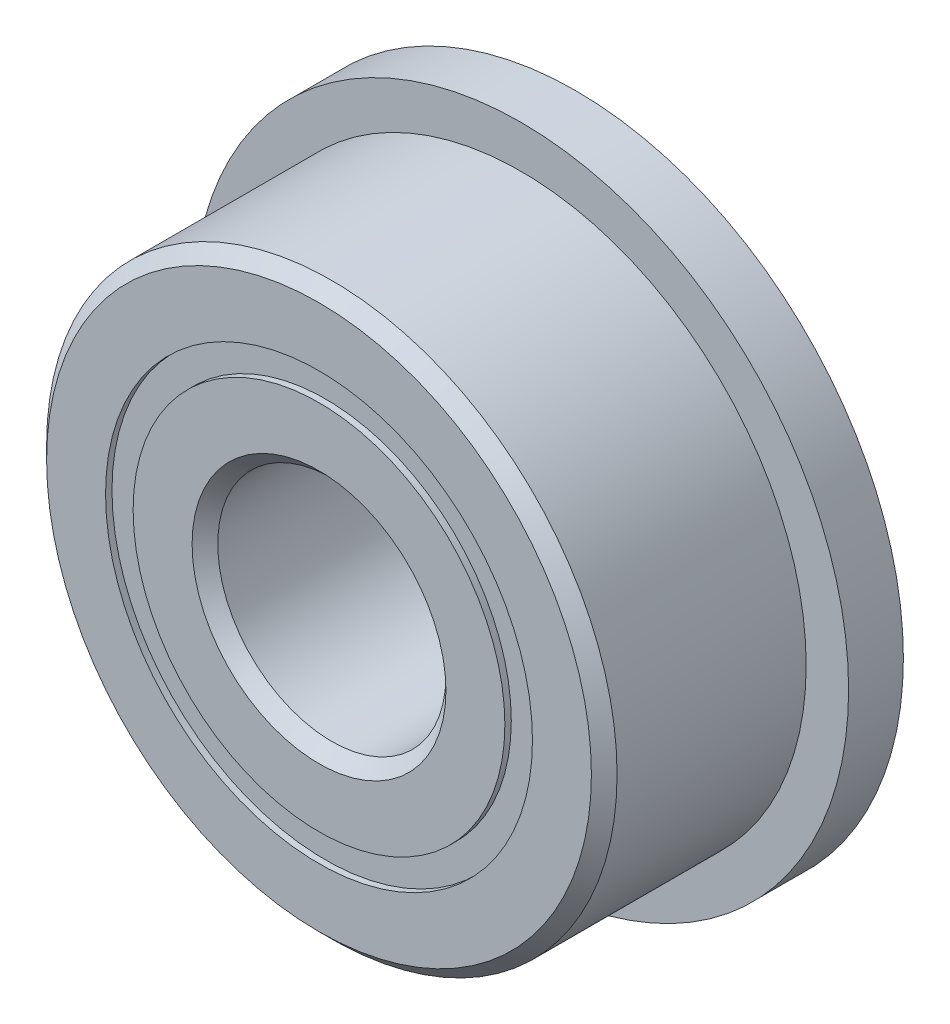
ISO-10303-21;
HEADER;
FILE_DESCRIPTION(('STEP AP214'),'2;1');
FILE_NAME('part.step','',(''),(''),'','','');
FILE_SCHEMA(('AUTOMOTIVE_DESIGN { 1 0 10303 214 1 1 1 1 }'));
ENDSEC;
DATA;
#1=APPLICATION_CONTEXT('core data for automotive mechanical design processes');
#2=APPLICATION_PROTOCOL_DEFINITION('international standard','automotive_design',2000,#1);
#3=PRODUCT_CONTEXT('',#1,'mechanical');
#4=PRODUCT('Part','Part','',(#3));
#5=PRODUCT_RELATED_PRODUCT_CATEGORY('part','',(#4));
#6=PRODUCT_DEFINITION_FORMATION('','',#4);
#7=PRODUCT_DEFINITION_CONTEXT('part definition',#1,'design');
#8=PRODUCT_DEFINITION('design','',#6,#7);
#9=PRODUCT_DEFINITION_SHAPE('','',#8);
#10=(LENGTH_UNIT() NAMED_UNIT(*) SI_UNIT(.MILLI.,.METRE.));
#11=(NAMED_UNIT(*) PLANE_ANGLE_UNIT() SI_UNIT($,.RADIAN.));
#12=(NAMED_UNIT(*) SI_UNIT($,.STERADIAN.) SOLID_ANGLE_UNIT());
#13=UNCERTAINTY_MEASURE_WITH_UNIT(LENGTH_MEASURE(1.E-05),#10,'distance_accuracy_value','');
#14=(GEOMETRIC_REPRESENTATION_CONTEXT(3) GLOBAL_UNCERTAINTY_ASSIGNED_CONTEXT((#13)) GLOBAL_UNIT_ASSIGNED_CONTEXT((#10,
#11,#12)) REPRESENTATION_CONTEXT('',''));
#15=CARTESIAN_POINT('',(0.,0.,0.));
#16=DIRECTION('',(0.,0.,1.));
#17=DIRECTION('',(1.,0.,0.));
#18=AXIS2_PLACEMENT_3D('',#15,#16,#17);
#19=CARTESIAN_POINT('',(0.,2.9700206043956,-1.696640625));
#20=DIRECTION('',(0.,0.,1.));
#21=DIRECTION('',(1.,0.,0.));
#22=AXIS2_PLACEMENT_3D('',#19,#20,#21);
#23=PLANE('',#22);
#24=CARTESIAN_POINT('',(0.,0.,-1.696640625));
#25=DIRECTION('',(0.,0.,1.));
#26=DIRECTION('',(1.,0.,0.));
#27=AXIS2_PLACEMENT_3D('',#24,#25,#26);
#28=CIRCLE('',#27,2.9700206043956);
#29=CARTESIAN_POINT('',(2.9700206043956,0.,-1.696640625));
#30=VERTEX_POINT('',#29);
#31=EDGE_CURVE('E55',#30,#30,#28,.T.);
#32=ORIENTED_EDGE('',*,*,#31,.F.);
#33=EDGE_LOOP('',(#32));
#34=FACE_BOUND('',#33,.T.);
#35=CARTESIAN_POINT('',(0.,0.,-1.696640625));
#36=DIRECTION('',(0.,0.,1.));
#37=DIRECTION('',(1.,0.,0.));
#38=AXIS2_PLACEMENT_3D('',#35,#36,#37);
#39=CIRCLE('',#38,2.5862293956044);
#40=CARTESIAN_POINT('',(2.5862293956044,0.,-1.696640625));
#41=VERTEX_POINT('',#40);
#42=EDGE_CURVE('E11',#41,#41,#39,.T.);
#43=ORIENTED_EDGE('',*,*,#42,.T.);
#44=EDGE_LOOP('',(#43));
#45=FACE_BOUND('',#44,.T.);
#46=ADVANCED_FACE('F41',(#34,#45),#23,.F.);
#47=CARTESIAN_POINT('',(0.,0.,1.7859375));
#48=DIRECTION('',(0.,0.,1.));
#49=DIRECTION('',(1.,0.,0.));
#50=AXIS2_PLACEMENT_3D('',#47,#48,#49);
#51=CYLINDRICAL_SURFACE('',#50,2.5862293956044);
#52=ORIENTED_EDGE('',*,*,#42,.F.);
#53=EDGE_LOOP('',(#52));
#54=FACE_BOUND('',#53,.T.);
#55=CARTESIAN_POINT('',(0.,0.,-0.816616792312254));
#56=DIRECTION('',(0.,0.,1.));
#57=DIRECTION('',(1.,0.,0.));
#58=AXIS2_PLACEMENT_3D('',#55,#56,#57);
#59=CIRCLE('',#58,2.5862293956044);
#60=CARTESIAN_POINT('',(2.5862293956044,0.,-0.816616792312254));
#61=VERTEX_POINT('',#60);
#62=EDGE_CURVE('E47',#61,#61,#59,.T.);
#63=ORIENTED_EDGE('',*,*,#62,.T.);
#64=EDGE_LOOP('',(#63));
#65=FACE_BOUND('',#64,.T.);
#66=ADVANCED_FACE('F64',(#54,#65),#51,.F.);
#67=CARTESIAN_POINT('',(0.,2.9700206043956,-0.816616792312254));
#68=DIRECTION('',(0.,0.,-1.));
#69=DIRECTION('',(-1.,0.,0.));
#70=AXIS2_PLACEMENT_3D('',#67,#68,#69);
#71=PLANE('',#70);
#72=ORIENTED_EDGE('',*,*,#62,.F.);
#73=EDGE_LOOP('',(#72));
#74=FACE_BOUND('',#73,.T.);
#75=CARTESIAN_POINT('',(0.,0.,-0.816616792312254));
#76=DIRECTION('',(0.,0.,1.));
#77=DIRECTION('',(1.,0.,0.));
#78=AXIS2_PLACEMENT_3D('',#75,#76,#77);
#79=CIRCLE('',#78,2.9700206043956);
#80=CARTESIAN_POINT('',(2.9700206043956,0.,-0.816616792312254));
#81=VERTEX_POINT('',#80);
#82=EDGE_CURVE('E51',#81,#81,#79,.T.);
#83=ORIENTED_EDGE('',*,*,#82,.T.);
#84=EDGE_LOOP('',(#83));
#85=FACE_BOUND('',#84,.T.);
#86=ADVANCED_FACE('F68',(#74,#85),#71,.F.);
#87=CARTESIAN_POINT('',(0.,0.,1.7859375));
#88=DIRECTION('',(0.,0.,1.));
#89=DIRECTION('',(1.,0.,0.));
#90=AXIS2_PLACEMENT_3D('',#87,#88,#89);
#91=CYLINDRICAL_SURFACE('',#90,2.9700206043956);
#92=ORIENTED_EDGE('',*,*,#82,.F.);
#93=EDGE_LOOP('',(#92));
#94=FACE_BOUND('',#93,.T.);
#95=ORIENTED_EDGE('',*,*,#31,.T.);
#96=EDGE_LOOP('',(#95));
#97=FACE_BOUND('',#96,.T.);
#98=ADVANCED_FACE('F61',(#94,#97),#91,.T.);
#99=CLOSED_SHELL('',(#46,#66,#86,#98));
#100=MANIFOLD_SOLID_BREP('B2',#99);
#101=CARTESIAN_POINT('',(0.,2.9700206043956,1.696640625));
#102=DIRECTION('',(0.,0.,-1.));
#103=DIRECTION('',(-1.,0.,0.));
#104=AXIS2_PLACEMENT_3D('',#101,#102,#103);
#105=PLANE('',#104);
#106=CARTESIAN_POINT('',(0.,0.,1.696640625));
#107=DIRECTION('',(0.,0.,1.));
#108=DIRECTION('',(1.,0.,0.));
#109=AXIS2_PLACEMENT_3D('',#106,#107,#108);
#110=CIRCLE('',#109,2.5862293956044);
#111=CARTESIAN_POINT('',(2.5862293956044,0.,1.696640625));
#112=VERTEX_POINT('',#111);
#113=EDGE_CURVE('E40',#112,#112,#110,.T.);
#114=ORIENTED_EDGE('',*,*,#113,.F.);
#115=EDGE_LOOP('',(#114));
#116=FACE_BOUND('',#115,.T.);
#117=CARTESIAN_POINT('',(0.,0.,1.696640625));
#118=DIRECTION('',(0.,0.,1.));
#119=DIRECTION('',(1.,0.,0.));
#120=AXIS2_PLACEMENT_3D('',#117,#118,#119);
#121=CIRCLE('',#120,2.9700206043956);
#122=CARTESIAN_POINT('',(2.9700206043956,0.,1.696640625));
#123=VERTEX_POINT('',#122);
#124=EDGE_CURVE('E122',#123,#123,#121,.T.);
#125=ORIENTED_EDGE('',*,*,#124,.T.);
#126=EDGE_LOOP('',(#125));
#127=FACE_BOUND('',#126,.T.);
#128=ADVANCED_FACE('F108',(#116,#127),#105,.F.);
#129=CARTESIAN_POINT('',(0.,0.,1.7859375));
#130=DIRECTION('',(0.,0.,1.));
#131=DIRECTION('',(1.,0.,0.));
#132=AXIS2_PLACEMENT_3D('',#129,#130,#131);
#133=CYLINDRICAL_SURFACE('',#132,2.5862293956044);
#134=CARTESIAN_POINT('',(0.,0.,0.816616792312253));
#135=DIRECTION('',(0.,0.,1.));
#136=DIRECTION('',(1.,0.,0.));
#137=AXIS2_PLACEMENT_3D('',#134,#135,#136);
#138=CIRCLE('',#137,2.5862293956044);
#139=CARTESIAN_POINT('',(2.5862293956044,0.,0.816616792312253));
#140=VERTEX_POINT('',#139);
#141=EDGE_CURVE('E114',#140,#140,#138,.T.);
#142=ORIENTED_EDGE('',*,*,#141,.F.);
#143=EDGE_LOOP('',(#142));
#144=FACE_BOUND('',#143,.T.);
#145=ORIENTED_EDGE('',*,*,#113,.T.);
#146=EDGE_LOOP('',(#145));
#147=FACE_BOUND('',#146,.T.);
#148=ADVANCED_FACE('F137',(#144,#147),#133,.F.);
#149=CARTESIAN_POINT('',(0.,2.9700206043956,0.816616792312253));
#150=DIRECTION('',(0.,0.,1.));
#151=DIRECTION('',(1.,0.,0.));
#152=AXIS2_PLACEMENT_3D('',#149,#150,#151);
#153=PLANE('',#152);
#154=CARTESIAN_POINT('',(0.,0.,0.816616792312253));
#155=DIRECTION('',(0.,0.,1.));
#156=DIRECTION('',(1.,0.,0.));
#157=AXIS2_PLACEMENT_3D('',#154,#155,#156);
#158=CIRCLE('',#157,2.9700206043956);
#159=CARTESIAN_POINT('',(2.9700206043956,0.,0.816616792312253));
#160=VERTEX_POINT('',#159);
#161=EDGE_CURVE('E118',#160,#160,#158,.T.);
#162=ORIENTED_EDGE('',*,*,#161,.F.);
#163=EDGE_LOOP('',(#162));
#164=FACE_BOUND('',#163,.T.);
#165=ORIENTED_EDGE('',*,*,#141,.T.);
#166=EDGE_LOOP('',(#165));
#167=FACE_BOUND('',#166,.T.);
#168=ADVANCED_FACE('F132',(#164,#167),#153,.F.);
#169=CARTESIAN_POINT('',(0.,0.,1.7859375));
#170=DIRECTION('',(0.,0.,1.));
#171=DIRECTION('',(1.,0.,0.));
#172=AXIS2_PLACEMENT_3D('',#169,#170,#171);
#173=CYLINDRICAL_SURFACE('',#172,2.9700206043956);
#174=ORIENTED_EDGE('',*,*,#124,.F.);
#175=EDGE_LOOP('',(#174));
#176=FACE_BOUND('',#175,.T.);
#177=ORIENTED_EDGE('',*,*,#161,.T.);
#178=EDGE_LOOP('',(#177));
#179=FACE_BOUND('',#178,.T.);
#180=ADVANCED_FACE('F129',(#176,#179),#173,.T.);
#181=CLOSED_SHELL('',(#128,#148,#168,#180));
#182=MANIFOLD_SOLID_BREP('B6',#181);
#183=CARTESIAN_POINT('',(-1.38906249999997,2.40592682488866,0.));
#184=DIRECTION('',(0.,0.,1.));
#185=DIRECTION('',(-0.499999999999989,0.866025403784445,0.));
#186=AXIS2_PLACEMENT_3D('',#183,#184,#185);
#187=SPHERICAL_SURFACE('',#186,0.816616792312253);
#188=CARTESIAN_POINT('',(-1.38906249999997,2.40592682488866,0.816616792312253));
#189=VERTEX_POINT('',#188);
#190=VERTEX_LOOP('',#189);
#191=FACE_BOUND('',#190,.T.);
#192=ADVANCED_FACE('F175',(#191),#187,.T.);
#193=CLOSED_SHELL('',(#192));
#194=MANIFOLD_SOLID_BREP('B35',#193);
#195=CARTESIAN_POINT('',(-2.40592682488863,1.38906250000003,0.));
#196=DIRECTION('',(0.,0.,1.));
#197=DIRECTION('',(-0.866025403784433,0.50000000000001,0.));
#198=AXIS2_PLACEMENT_3D('',#195,#196,#197);
#199=SPHERICAL_SURFACE('',#198,0.816616792312253);
#200=CARTESIAN_POINT('',(-2.40592682488863,1.38906250000003,0.816616792312253));
#201=VERTEX_POINT('',#200);
#202=VERTEX_LOOP('',#201);
#203=FACE_BOUND('',#202,.T.);
#204=ADVANCED_FACE('F195',(#203),#199,.T.);
#205=CLOSED_SHELL('',(#204));
#206=MANIFOLD_SOLID_BREP('B104',#205);
#207=CARTESIAN_POINT('',(-2.778125,0.,0.));
#208=DIRECTION('',(0.,0.,1.));
#209=DIRECTION('',(-1.,0.,0.));
#210=AXIS2_PLACEMENT_3D('',#207,#208,#209);
#211=SPHERICAL_SURFACE('',#210,0.816616792312253);
#212=CARTESIAN_POINT('',(-2.778125,0.,0.816616792312253));
#213=VERTEX_POINT('',#212);
#214=VERTEX_LOOP('',#213);
#215=FACE_BOUND('',#214,.T.);
#216=ADVANCED_FACE('F215',(#215),#211,.T.);
#217=CLOSED_SHELL('',(#216));
#218=MANIFOLD_SOLID_BREP('B171',#217);
#219=CARTESIAN_POINT('',(-2.40592682488866,-1.38906249999998,0.));
#220=DIRECTION('',(0.,0.,1.));
#221=DIRECTION('',(-0.866025403784443,-0.499999999999992,0.));
#222=AXIS2_PLACEMENT_3D('',#219,#220,#221);
#223=SPHERICAL_SURFACE('',#222,0.816616792312253);
#224=CARTESIAN_POINT('',(-2.40592682488866,-1.38906249999998,0.816616792312253));
#225=VERTEX_POINT('',#224);
#226=VERTEX_LOOP('',#225);
#227=FACE_BOUND('',#226,.T.);
#228=ADVANCED_FACE('F235',(#227),#223,.T.);
#229=CLOSED_SHELL('',(#228));
#230=MANIFOLD_SOLID_BREP('B191',#229);
#231=CARTESIAN_POINT('',(-1.38906250000002,-2.40592682488863,0.));
#232=DIRECTION('',(0.,0.,1.));
#233=DIRECTION('',(-0.500000000000007,-0.866025403784435,0.));
#234=AXIS2_PLACEMENT_3D('',#231,#232,#233);
#235=SPHERICAL_SURFACE('',#234,0.816616792312253);
#236=CARTESIAN_POINT('',(-1.38906250000002,-2.40592682488863,0.816616792312253));
#237=VERTEX_POINT('',#236);
#238=VERTEX_LOOP('',#237);
#239=FACE_BOUND('',#238,.T.);
#240=ADVANCED_FACE('F255',(#239),#235,.T.);
#241=CLOSED_SHELL('',(#240));
#242=MANIFOLD_SOLID_BREP('B211',#241);
#243=CARTESIAN_POINT('',(0.,-2.778125,0.));
#244=DIRECTION('',(0.,0.,1.));
#245=DIRECTION('',(0.,-1.,0.));
#246=AXIS2_PLACEMENT_3D('',#243,#244,#245);
#247=SPHERICAL_SURFACE('',#246,0.816616792312253);
#248=CARTESIAN_POINT('',(0.,-2.778125,0.816616792312253));
#249=VERTEX_POINT('',#248);
#250=VERTEX_LOOP('',#249);
#251=FACE_BOUND('',#250,.T.);
#252=ADVANCED_FACE('F275',(#251),#247,.T.);
#253=CLOSED_SHELL('',(#252));
#254=MANIFOLD_SOLID_BREP('B231',#253);
#255=CARTESIAN_POINT('',(1.38906249999999,-2.40592682488865,0.));
#256=DIRECTION('',(0.,0.,1.));
#257=DIRECTION('',(0.499999999999995,-0.866025403784442,0.));
#258=AXIS2_PLACEMENT_3D('',#255,#256,#257);
#259=SPHERICAL_SURFACE('',#258,0.816616792312253);
#260=CARTESIAN_POINT('',(1.38906249999999,-2.40592682488865,0.816616792312253));
#261=VERTEX_POINT('',#260);
#262=VERTEX_LOOP('',#261);
#263=FACE_BOUND('',#262,.T.);
#264=ADVANCED_FACE('F295',(#263),#259,.T.);
#265=CLOSED_SHELL('',(#264));
#266=MANIFOLD_SOLID_BREP('B251',#265);
#267=CARTESIAN_POINT('',(2.40592682488864,-1.38906250000001,0.));
#268=DIRECTION('',(0.,0.,1.));
#269=DIRECTION('',(0.866025403784436,-0.500000000000004,0.));
#270=AXIS2_PLACEMENT_3D('',#267,#268,#269);
#271=SPHERICAL_SURFACE('',#270,0.816616792312253);
#272=CARTESIAN_POINT('',(2.40592682488864,-1.38906250000001,0.816616792312253));
#273=VERTEX_POINT('',#272);
#274=VERTEX_LOOP('',#273);
#275=FACE_BOUND('',#274,.T.);
#276=ADVANCED_FACE('F315',(#275),#271,.T.);
#277=CLOSED_SHELL('',(#276));
#278=MANIFOLD_SOLID_BREP('B271',#277);
#279=CARTESIAN_POINT('',(2.778125,0.,0.));
#280=DIRECTION('',(0.,0.,1.));
#281=DIRECTION('',(1.,0.,0.));
#282=AXIS2_PLACEMENT_3D('',#279,#280,#281);
#283=SPHERICAL_SURFACE('',#282,0.816616792312253);
#284=CARTESIAN_POINT('',(2.778125,0.,0.816616792312253));
#285=VERTEX_POINT('',#284);
#286=VERTEX_LOOP('',#285);
#287=FACE_BOUND('',#286,.T.);
#288=ADVANCED_FACE('F335',(#287),#283,.T.);
#289=CLOSED_SHELL('',(#288));
#290=MANIFOLD_SOLID_BREP('B291',#289);
#291=CARTESIAN_POINT('',(2.40592682488865,1.38906249999999,0.));
#292=DIRECTION('',(0.,0.,1.));
#293=DIRECTION('',(0.86602540378444,0.499999999999998,0.));
#294=AXIS2_PLACEMENT_3D('',#291,#292,#293);
#295=SPHERICAL_SURFACE('',#294,0.816616792312253);
#296=CARTESIAN_POINT('',(2.40592682488865,1.38906249999999,0.816616792312253));
#297=VERTEX_POINT('',#296);
#298=VERTEX_LOOP('',#297);
#299=FACE_BOUND('',#298,.T.);
#300=ADVANCED_FACE('F355',(#299),#295,.T.);
#301=CLOSED_SHELL('',(#300));
#302=MANIFOLD_SOLID_BREP('B311',#301);
#303=CARTESIAN_POINT('',(1.3890625,2.40592682488864,0.));
#304=DIRECTION('',(0.,0.,1.));
#305=DIRECTION('',(0.500000000000001,0.866025403784438,0.));
#306=AXIS2_PLACEMENT_3D('',#303,#304,#305);
#307=SPHERICAL_SURFACE('',#306,0.816616792312253);
#308=CARTESIAN_POINT('',(1.3890625,2.40592682488864,0.816616792312253));
#309=VERTEX_POINT('',#308);
#310=VERTEX_LOOP('',#309);
#311=FACE_BOUND('',#310,.T.);
#312=ADVANCED_FACE('F375',(#311),#307,.T.);
#313=CLOSED_SHELL('',(#312));
#314=MANIFOLD_SOLID_BREP('B331',#313);
#315=CARTESIAN_POINT('',(0.,2.778125,0.));
#316=DIRECTION('',(0.,0.,1.));
#317=DIRECTION('',(0.,1.,0.));
#318=AXIS2_PLACEMENT_3D('',#315,#316,#317);
#319=SPHERICAL_SURFACE('',#318,0.816616792312253);
#320=CARTESIAN_POINT('',(0.,2.778125,0.816616792312253));
#321=VERTEX_POINT('',#320);
#322=VERTEX_LOOP('',#321);
#323=FACE_BOUND('',#322,.T.);
#324=ADVANCED_FACE('F397',(#323),#319,.T.);
#325=CLOSED_SHELL('',(#324));
#326=MANIFOLD_SOLID_BREP('B351',#325);
#327=CARTESIAN_POINT('',(0.,2.5862293956044,1.7859375));
#328=DIRECTION('',(0.,0.,-1.));
#329=DIRECTION('',(-1.,0.,0.));
#330=AXIS2_PLACEMENT_3D('',#327,#328,#329);
#331=PLANE('',#330);
#332=CARTESIAN_POINT('',(0.,0.,1.7859375));
#333=DIRECTION('',(0.,0.,1.));
#334=DIRECTION('',(1.,0.,0.));
#335=AXIS2_PLACEMENT_3D('',#332,#333,#334);
#336=CIRCLE('',#335,1.76609375);
#337=CARTESIAN_POINT('',(1.76609375,0.,1.7859375));
#338=VERTEX_POINT('',#337);
#339=EDGE_CURVE('E444',#338,#338,#336,.T.);
#340=ORIENTED_EDGE('',*,*,#339,.F.);
#341=EDGE_LOOP('',(#340));
#342=FACE_BOUND('',#341,.T.);
#343=CARTESIAN_POINT('',(0.,0.,1.7859375));
#344=DIRECTION('',(0.,0.,1.));
#345=DIRECTION('',(1.,0.,0.));
#346=AXIS2_PLACEMENT_3D('',#343,#344,#345);
#347=CIRCLE('',#346,2.5862293956044);
#348=CARTESIAN_POINT('',(2.5862293956044,0.,1.7859375));
#349=VERTEX_POINT('',#348);
#350=EDGE_CURVE('E396',#349,#349,#347,.T.);
#351=ORIENTED_EDGE('',*,*,#350,.T.);
#352=EDGE_LOOP('',(#351));
#353=FACE_BOUND('',#352,.T.);
#354=ADVANCED_FACE('F416',(#342,#353),#331,.F.);
#355=CARTESIAN_POINT('',(0.,0.,1.7859375));
#356=DIRECTION('',(0.,0.,1.));
#357=DIRECTION('',(1.,0.,0.));
#358=AXIS2_PLACEMENT_3D('',#355,#356,#357);
#359=CYLINDRICAL_SURFACE('',#358,2.5862293956044);
#360=ORIENTED_EDGE('',*,*,#350,.F.);
#361=EDGE_LOOP('',(#360));
#362=FACE_BOUND('',#361,.T.);
#363=CARTESIAN_POINT('',(0.,0.,0.79375));
#364=DIRECTION('',(0.,0.,1.));
#365=DIRECTION('',(1.,0.,0.));
#366=AXIS2_PLACEMENT_3D('',#363,#364,#365);
#367=CIRCLE('',#366,2.5862293956044);
#368=CARTESIAN_POINT('',(2.5862293956044,0.,0.79375));
#369=VERTEX_POINT('',#368);
#370=EDGE_CURVE('E422',#369,#369,#367,.T.);
#371=ORIENTED_EDGE('',*,*,#370,.T.);
#372=EDGE_LOOP('',(#371));
#373=FACE_BOUND('',#372,.T.);
#374=ADVANCED_FACE('F451',(#362,#373),#359,.T.);
#375=CARTESIAN_POINT('',(0.,0.,0.));
#376=DIRECTION('',(0.,0.,1.));
#377=DIRECTION('',(1.,0.,0.));
#378=AXIS2_PLACEMENT_3D('',#375,#376,#377);
#379=TOROIDAL_SURFACE('',#378,2.778125,0.816616792312252);
#380=ORIENTED_EDGE('',*,*,#370,.F.);
#381=EDGE_LOOP('',(#380));
#382=FACE_BOUND('',#381,.T.);
#383=CARTESIAN_POINT('',(0.,0.,-0.793750000000001));
#384=DIRECTION('',(0.,0.,1.));
#385=DIRECTION('',(1.,0.,0.));
#386=AXIS2_PLACEMENT_3D('',#383,#384,#385);
#387=CIRCLE('',#386,2.5862293956044);
#388=CARTESIAN_POINT('',(2.5862293956044,0.,-0.793750000000001));
#389=VERTEX_POINT('',#388);
#390=EDGE_CURVE('E426',#389,#389,#387,.T.);
#391=ORIENTED_EDGE('',*,*,#390,.T.);
#392=EDGE_LOOP('',(#391));
#393=FACE_BOUND('',#392,.T.);
#394=ADVANCED_FACE('F455',(#382,#393),#379,.F.);
#395=CARTESIAN_POINT('',(0.,0.,1.7859375));
#396=DIRECTION('',(0.,0.,1.));
#397=DIRECTION('',(1.,0.,0.));
#398=AXIS2_PLACEMENT_3D('',#395,#396,#397);
#399=CYLINDRICAL_SURFACE('',#398,2.5862293956044);
#400=ORIENTED_EDGE('',*,*,#390,.F.);
#401=EDGE_LOOP('',(#400));
#402=FACE_BOUND('',#401,.T.);
#403=CARTESIAN_POINT('',(0.,0.,-1.7859375));
#404=DIRECTION('',(0.,0.,1.));
#405=DIRECTION('',(1.,0.,0.));
#406=AXIS2_PLACEMENT_3D('',#403,#404,#405);
#407=CIRCLE('',#406,2.5862293956044);
#408=CARTESIAN_POINT('',(2.5862293956044,0.,-1.7859375));
#409=VERTEX_POINT('',#408);
#410=EDGE_CURVE('E430',#409,#409,#407,.T.);
#411=ORIENTED_EDGE('',*,*,#410,.T.);
#412=EDGE_LOOP('',(#411));
#413=FACE_BOUND('',#412,.T.);
#414=ADVANCED_FACE('F460',(#402,#413),#399,.T.);
#415=CARTESIAN_POINT('',(0.,1.76609375,-1.7859375));
#416=DIRECTION('',(0.,0.,1.));
#417=DIRECTION('',(1.,0.,0.));
#418=AXIS2_PLACEMENT_3D('',#415,#416,#417);
#419=PLANE('',#418);
#420=ORIENTED_EDGE('',*,*,#410,.F.);
#421=EDGE_LOOP('',(#420));
#422=FACE_BOUND('',#421,.T.);
#423=CARTESIAN_POINT('',(0.,0.,-1.7859375));
#424=DIRECTION('',(0.,0.,1.));
#425=DIRECTION('',(1.,0.,0.));
#426=AXIS2_PLACEMENT_3D('',#423,#424,#425);
#427=CIRCLE('',#426,1.76609375);
#428=CARTESIAN_POINT('',(1.76609375,0.,-1.7859375));
#429=VERTEX_POINT('',#428);
#430=EDGE_CURVE('E435',#429,#429,#427,.T.);
#431=ORIENTED_EDGE('',*,*,#430,.T.);
#432=EDGE_LOOP('',(#431));
#433=FACE_BOUND('',#432,.T.);
#434=ADVANCED_FACE('F466',(#422,#433),#419,.F.);
#435=CARTESIAN_POINT('',(0.,0.,-1.60734375));
#436=DIRECTION('',(0.,0.,-1.));
#437=DIRECTION('',(-1.,0.,0.));
#438=AXIS2_PLACEMENT_3D('',#435,#436,#437);
#439=CONICAL_SURFACE('',#438,1.5875,0.785398163397448);
#440=ORIENTED_EDGE('',*,*,#430,.F.);
#441=EDGE_LOOP('',(#440));
#442=FACE_BOUND('',#441,.T.);
#443=CARTESIAN_POINT('',(0.,0.,-1.60734375));
#444=DIRECTION('',(0.,0.,1.));
#445=DIRECTION('',(1.,0.,0.));
#446=AXIS2_PLACEMENT_3D('',#443,#444,#445);
#447=CIRCLE('',#446,1.5875);
#448=CARTESIAN_POINT('',(1.5875,0.,-1.60734375));
#449=VERTEX_POINT('',#448);
#450=EDGE_CURVE('E438',#449,#449,#447,.T.);
#451=ORIENTED_EDGE('',*,*,#450,.T.);
#452=EDGE_LOOP('',(#451));
#453=FACE_BOUND('',#452,.T.);
#454=ADVANCED_FACE('F470',(#442,#453),#439,.F.);
#455=CARTESIAN_POINT('',(0.,0.,1.7859375));
#456=DIRECTION('',(0.,0.,1.));
#457=DIRECTION('',(1.,0.,0.));
#458=AXIS2_PLACEMENT_3D('',#455,#456,#457);
#459=CYLINDRICAL_SURFACE('',#458,1.5875);
#460=ORIENTED_EDGE('',*,*,#450,.F.);
#461=EDGE_LOOP('',(#460));
#462=FACE_BOUND('',#461,.T.);
#463=CARTESIAN_POINT('',(0.,0.,1.60734375));
#464=DIRECTION('',(0.,0.,1.));
#465=DIRECTION('',(1.,0.,0.));
#466=AXIS2_PLACEMENT_3D('',#463,#464,#465);
#467=CIRCLE('',#466,1.5875);
#468=CARTESIAN_POINT('',(1.5875,0.,1.60734375));
#469=VERTEX_POINT('',#468);
#470=EDGE_CURVE('E441',#469,#469,#467,.T.);
#471=ORIENTED_EDGE('',*,*,#470,.T.);
#472=EDGE_LOOP('',(#471));
#473=FACE_BOUND('',#472,.T.);
#474=ADVANCED_FACE('F474',(#462,#473),#459,.F.);
#475=CARTESIAN_POINT('',(0.,0.,1.7859375));
#476=DIRECTION('',(0.,0.,1.));
#477=DIRECTION('',(1.,0.,0.));
#478=AXIS2_PLACEMENT_3D('',#475,#476,#477);
#479=CONICAL_SURFACE('',#478,1.76609375,0.785398163397453);
#480=ORIENTED_EDGE('',*,*,#470,.F.);
#481=EDGE_LOOP('',(#480));
#482=FACE_BOUND('',#481,.T.);
#483=ORIENTED_EDGE('',*,*,#339,.T.);
#484=EDGE_LOOP('',(#483));
#485=FACE_BOUND('',#484,.T.);
#486=ADVANCED_FACE('F448',(#482,#485),#479,.F.);
#487=CLOSED_SHELL('',(#354,#374,#394,#414,#434,#454,#474,#486));
#488=MANIFOLD_SOLID_BREP('B371',#487);
#489=CARTESIAN_POINT('',(0.,0.,1.60734375));
#490=DIRECTION('',(0.,0.,-1.));
#491=DIRECTION('',(-1.,0.,0.));
#492=AXIS2_PLACEMENT_3D('',#489,#490,#491);
#493=CONICAL_SURFACE('',#492,3.96875,0.785398163397448);
#494=CARTESIAN_POINT('',(0.,0.,1.7859375));
#495=DIRECTION('',(0.,0.,1.));
#496=DIRECTION('',(1.,0.,0.));
#497=AXIS2_PLACEMENT_3D('',#494,#495,#496);
#498=CIRCLE('',#497,3.79015625);
#499=CARTESIAN_POINT('',(3.79015625,0.,1.7859375));
#500=VERTEX_POINT('',#499);
#501=EDGE_CURVE('E559',#500,#500,#498,.T.);
#502=ORIENTED_EDGE('',*,*,#501,.F.);
#503=EDGE_LOOP('',(#502));
#504=FACE_BOUND('',#503,.T.);
#505=CARTESIAN_POINT('',(0.,0.,1.60734375));
#506=DIRECTION('',(0.,0.,1.));
#507=DIRECTION('',(1.,0.,0.));
#508=AXIS2_PLACEMENT_3D('',#505,#506,#507);
#509=CIRCLE('',#508,3.96875);
#510=CARTESIAN_POINT('',(3.96875,0.,1.60734375));
#511=VERTEX_POINT('',#510);
#512=EDGE_CURVE('E415',#511,#511,#509,.T.);
#513=ORIENTED_EDGE('',*,*,#512,.T.);
#514=EDGE_LOOP('',(#513));
#515=FACE_BOUND('',#514,.T.);
#516=ADVANCED_FACE('F537',(#504,#515),#493,.T.);
#517=CARTESIAN_POINT('',(0.,0.,1.7859375));
#518=DIRECTION('',(0.,0.,1.));
#519=DIRECTION('',(1.,0.,0.));
#520=AXIS2_PLACEMENT_3D('',#517,#518,#519);
#521=CYLINDRICAL_SURFACE('',#520,3.96875);
#522=CARTESIAN_POINT('',(0.,0.,-1.0239375));
#523=DIRECTION('',(0.,0.,1.));
#524=DIRECTION('',(1.,0.,0.));
#525=AXIS2_PLACEMENT_3D('',#522,#523,#524);
#526=CIRCLE('',#525,3.96875);
#527=CARTESIAN_POINT('',(3.96875,0.,-1.0239375));
#528=VERTEX_POINT('',#527);
#529=EDGE_CURVE('E562',#528,#528,#526,.T.);
#530=ORIENTED_EDGE('',*,*,#529,.T.);
#531=EDGE_LOOP('',(#530));
#532=FACE_BOUND('',#531,.T.);
#533=ORIENTED_EDGE('',*,*,#512,.F.);
#534=EDGE_LOOP('',(#533));
#535=FACE_BOUND('',#534,.T.);
#536=ADVANCED_FACE('F582',(#532,#535),#521,.T.);
#537=CARTESIAN_POINT('',(0.,3.79015625,-1.7859375));
#538=DIRECTION('',(0.,0.,1.));
#539=DIRECTION('',(1.,0.,0.));
#540=AXIS2_PLACEMENT_3D('',#537,#538,#539);
#541=PLANE('',#540);
#542=CARTESIAN_POINT('',(0.,0.,-1.7859375));
#543=DIRECTION('',(0.,0.,1.));
#544=DIRECTION('',(1.,0.,0.));
#545=AXIS2_PLACEMENT_3D('',#542,#543,#544);
#546=CIRCLE('',#545,2.9700206043956);
#547=CARTESIAN_POINT('',(2.9700206043956,0.,-1.7859375));
#548=VERTEX_POINT('',#547);
#549=EDGE_CURVE('E543',#548,#548,#546,.T.);
#550=ORIENTED_EDGE('',*,*,#549,.T.);
#551=EDGE_LOOP('',(#550));
#552=FACE_BOUND('',#551,.T.);
#553=CARTESIAN_POINT('',(0.,0.,-1.7859375));
#554=DIRECTION('',(0.,0.,-1.));
#555=DIRECTION('',(-1.,0.,0.));
#556=AXIS2_PLACEMENT_3D('',#553,#554,#555);
#557=CIRCLE('',#556,4.5593);
#558=CARTESIAN_POINT('',(-4.5593,0.,-1.7859375));
#559=VERTEX_POINT('',#558);
#560=EDGE_CURVE('E565',#559,#559,#557,.T.);
#561=ORIENTED_EDGE('',*,*,#560,.T.);
#562=EDGE_LOOP('',(#561));
#563=FACE_BOUND('',#562,.T.);
#564=ADVANCED_FACE('F585',(#552,#563),#541,.F.);
#565=CARTESIAN_POINT('',(0.,0.,1.7859375));
#566=DIRECTION('',(0.,0.,1.));
#567=DIRECTION('',(1.,0.,0.));
#568=AXIS2_PLACEMENT_3D('',#565,#566,#567);
#569=CYLINDRICAL_SURFACE('',#568,2.9700206043956);
#570=CARTESIAN_POINT('',(0.,0.,-0.79375));
#571=DIRECTION('',(0.,0.,1.));
#572=DIRECTION('',(1.,0.,0.));
#573=AXIS2_PLACEMENT_3D('',#570,#571,#572);
#574=CIRCLE('',#573,2.9700206043956);
#575=CARTESIAN_POINT('',(2.9700206043956,0.,-0.79375));
#576=VERTEX_POINT('',#575);
#577=EDGE_CURVE('E547',#576,#576,#574,.T.);
#578=ORIENTED_EDGE('',*,*,#577,.T.);
#579=EDGE_LOOP('',(#578));
#580=FACE_BOUND('',#579,.T.);
#581=ORIENTED_EDGE('',*,*,#549,.F.);
#582=EDGE_LOOP('',(#581));
#583=FACE_BOUND('',#582,.T.);
#584=ADVANCED_FACE('F590',(#580,#583),#569,.F.);
#585=CARTESIAN_POINT('',(0.,0.,0.));
#586=DIRECTION('',(0.,0.,1.));
#587=DIRECTION('',(1.,0.,0.));
#588=AXIS2_PLACEMENT_3D('',#585,#586,#587);
#589=TOROIDAL_SURFACE('',#588,2.778125,0.816616792312253);
#590=ORIENTED_EDGE('',*,*,#577,.F.);
#591=EDGE_LOOP('',(#590));
#592=FACE_BOUND('',#591,.T.);
#593=CARTESIAN_POINT('',(0.,0.,0.79375));
#594=DIRECTION('',(0.,0.,1.));
#595=DIRECTION('',(1.,0.,0.));
#596=AXIS2_PLACEMENT_3D('',#593,#594,#595);
#597=CIRCLE('',#596,2.9700206043956);
#598=CARTESIAN_POINT('',(2.9700206043956,0.,0.79375));
#599=VERTEX_POINT('',#598);
#600=EDGE_CURVE('E551',#599,#599,#597,.T.);
#601=ORIENTED_EDGE('',*,*,#600,.T.);
#602=EDGE_LOOP('',(#601));
#603=FACE_BOUND('',#602,.T.);
#604=ADVANCED_FACE('F596',(#592,#603),#589,.F.);
#605=CARTESIAN_POINT('',(0.,0.,1.7859375));
#606=DIRECTION('',(0.,0.,1.));
#607=DIRECTION('',(1.,0.,0.));
#608=AXIS2_PLACEMENT_3D('',#605,#606,#607);
#609=CYLINDRICAL_SURFACE('',#608,2.9700206043956);
#610=ORIENTED_EDGE('',*,*,#600,.F.);
#611=EDGE_LOOP('',(#610));
#612=FACE_BOUND('',#611,.T.);
#613=CARTESIAN_POINT('',(0.,0.,1.7859375));
#614=DIRECTION('',(0.,0.,1.));
#615=DIRECTION('',(1.,0.,0.));
#616=AXIS2_PLACEMENT_3D('',#613,#614,#615);
#617=CIRCLE('',#616,2.9700206043956);
#618=CARTESIAN_POINT('',(2.9700206043956,0.,1.7859375));
#619=VERTEX_POINT('',#618);
#620=EDGE_CURVE('E556',#619,#619,#617,.T.);
#621=ORIENTED_EDGE('',*,*,#620,.T.);
#622=EDGE_LOOP('',(#621));
#623=FACE_BOUND('',#622,.T.);
#624=ADVANCED_FACE('F600',(#612,#623),#609,.F.);
#625=CARTESIAN_POINT('',(0.,3.79015625,1.7859375));
#626=DIRECTION('',(0.,0.,-1.));
#627=DIRECTION('',(-1.,0.,0.));
#628=AXIS2_PLACEMENT_3D('',#625,#626,#627);
#629=PLANE('',#628);
#630=ORIENTED_EDGE('',*,*,#620,.F.);
#631=EDGE_LOOP('',(#630));
#632=FACE_BOUND('',#631,.T.);
#633=ORIENTED_EDGE('',*,*,#501,.T.);
#634=EDGE_LOOP('',(#633));
#635=FACE_BOUND('',#634,.T.);
#636=ADVANCED_FACE('F578',(#632,#635),#629,.F.);
#637=CARTESIAN_POINT('',(0.,2.9700206043956,-1.0239375));
#638=DIRECTION('',(0.,0.,1.));
#639=DIRECTION('',(1.,0.,0.));
#640=AXIS2_PLACEMENT_3D('',#637,#638,#639);
#641=PLANE('',#640);
#642=CARTESIAN_POINT('',(0.,0.,-1.0239375));
#643=DIRECTION('',(0.,0.,-1.));
#644=DIRECTION('',(-1.,0.,0.));
#645=AXIS2_PLACEMENT_3D('',#642,#643,#644);
#646=CIRCLE('',#645,4.5593);
#647=CARTESIAN_POINT('',(-4.5593,0.,-1.0239375));
#648=VERTEX_POINT('',#647);
#649=EDGE_CURVE('E568',#648,#648,#646,.T.);
#650=ORIENTED_EDGE('',*,*,#649,.F.);
#651=EDGE_LOOP('',(#650));
#652=FACE_BOUND('',#651,.T.);
#653=ORIENTED_EDGE('',*,*,#529,.F.);
#654=EDGE_LOOP('',(#653));
#655=FACE_BOUND('',#654,.T.);
#656=ADVANCED_FACE('F575',(#652,#655),#641,.T.);
#657=CARTESIAN_POINT('',(0.,0.,-1.7859375));
#658=DIRECTION('',(0.,0.,-1.));
#659=DIRECTION('',(-1.,0.,0.));
#660=AXIS2_PLACEMENT_3D('',#657,#658,#659);
#661=CYLINDRICAL_SURFACE('',#660,4.5593);
#662=ORIENTED_EDGE('',*,*,#649,.T.);
#663=EDGE_LOOP('',(#662));
#664=FACE_BOUND('',#663,.T.);
#665=ORIENTED_EDGE('',*,*,#560,.F.);
#666=EDGE_LOOP('',(#665));
#667=FACE_BOUND('',#666,.T.);
#668=ADVANCED_FACE('F572',(#664,#667),#661,.T.);
#669=CLOSED_SHELL('',(#516,#536,#564,#584,#604,#624,#636,#656,#668));
#670=MANIFOLD_SOLID_BREP('B391',#669);
#671=ADVANCED_BREP_SHAPE_REPRESENTATION('',(#18,#100,#182,#194,#206,#218,#230,#242,#254,#266,
#278,#290,#302,#314,#326,#488,#670),#14);
#672=SHAPE_DEFINITION_REPRESENTATION(#9,#671);
ENDSEC;
END-ISO-10303-21;
